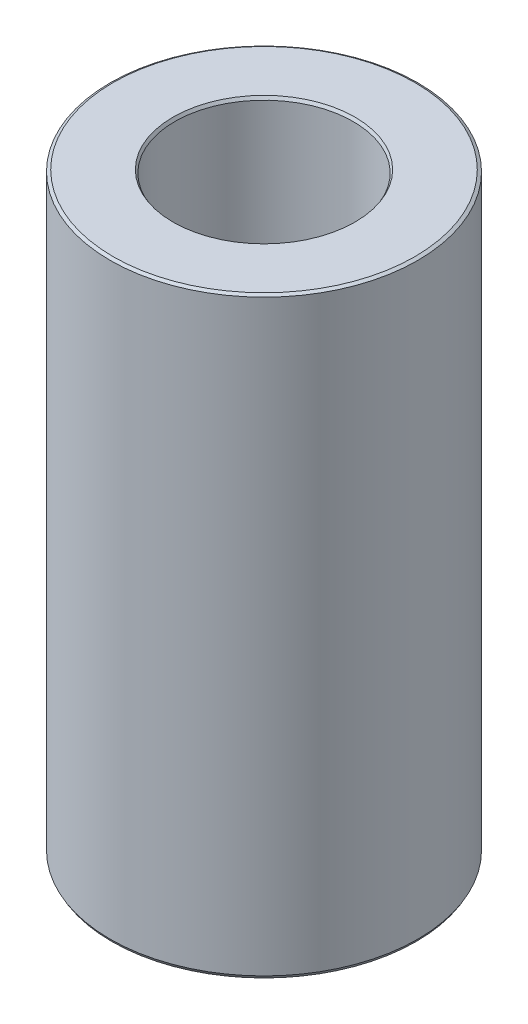
ISO-10303-21;
HEADER;
FILE_DESCRIPTION(('STEP AP214'),'2;1');
FILE_NAME('part.step','',(''),(''),'','','');
FILE_SCHEMA(('AUTOMOTIVE_DESIGN { 1 0 10303 214 1 1 1 1 }'));
ENDSEC;
DATA;
#1=APPLICATION_CONTEXT('core data for automotive mechanical design processes');
#2=APPLICATION_PROTOCOL_DEFINITION('international standard','automotive_design',2000,#1);
#3=PRODUCT_CONTEXT('',#1,'mechanical');
#4=PRODUCT('Part','Part','',(#3));
#5=PRODUCT_RELATED_PRODUCT_CATEGORY('part','',(#4));
#6=PRODUCT_DEFINITION_FORMATION('','',#4);
#7=PRODUCT_DEFINITION_CONTEXT('part definition',#1,'design');
#8=PRODUCT_DEFINITION('design','',#6,#7);
#9=PRODUCT_DEFINITION_SHAPE('','',#8);
#10=(LENGTH_UNIT() NAMED_UNIT(*) SI_UNIT(.MILLI.,.METRE.));
#11=(NAMED_UNIT(*) PLANE_ANGLE_UNIT() SI_UNIT($,.RADIAN.));
#12=(NAMED_UNIT(*) SI_UNIT($,.STERADIAN.) SOLID_ANGLE_UNIT());
#13=UNCERTAINTY_MEASURE_WITH_UNIT(LENGTH_MEASURE(1.E-05),#10,'distance_accuracy_value','');
#14=(GEOMETRIC_REPRESENTATION_CONTEXT(3) GLOBAL_UNCERTAINTY_ASSIGNED_CONTEXT((#13)) GLOBAL_UNIT_ASSIGNED_CONTEXT((#10,
#11,#12)) REPRESENTATION_CONTEXT('',''));
#15=CARTESIAN_POINT('',(0.,0.,0.));
#16=DIRECTION('',(0.,0.,1.));
#17=DIRECTION('',(1.,0.,0.));
#18=AXIS2_PLACEMENT_3D('',#15,#16,#17);
#19=CARTESIAN_POINT('',(0.,221.507115147404,0.));
#20=DIRECTION('',(0.,-1.,0.));
#21=DIRECTION('',(0.,0.,-1.));
#22=AXIS2_PLACEMENT_3D('',#19,#20,#21);
#23=CYLINDRICAL_SURFACE('',#22,57.5);
#24=CARTESIAN_POINT('',(0.,1.11630330257123,0.));
#25=DIRECTION('',(0.,1.,0.));
#26=DIRECTION('',(0.,0.,1.));
#27=AXIS2_PLACEMENT_3D('',#24,#25,#26);
#28=CIRCLE('',#27,57.5);
#29=CARTESIAN_POINT('',(0.,1.11630330257123,57.5));
#30=VERTEX_POINT('',#29);
#31=EDGE_CURVE('E10',#30,#30,#28,.T.);
#32=ORIENTED_EDGE('',*,*,#31,.T.);
#33=EDGE_LOOP('',(#32));
#34=FACE_BOUND('',#33,.T.);
#35=CARTESIAN_POINT('',(0.,220.862617135167,0.));
#36=DIRECTION('',(0.,1.,0.));
#37=DIRECTION('',(0.,0.,1.));
#38=AXIS2_PLACEMENT_3D('',#35,#36,#37);
#39=CIRCLE('',#38,57.5);
#40=CARTESIAN_POINT('',(0.,220.862617135167,57.5));
#41=VERTEX_POINT('',#40);
#42=EDGE_CURVE('E50',#41,#41,#39,.F.);
#43=ORIENTED_EDGE('',*,*,#42,.T.);
#44=EDGE_LOOP('',(#43));
#45=FACE_BOUND('',#44,.T.);
#46=ADVANCED_FACE('F39',(#34,#45),#23,.T.);
#47=CARTESIAN_POINT('',(0.,221.507115147404,0.));
#48=DIRECTION('',(0.,1.,0.));
#49=DIRECTION('',(0.,0.,1.));
#50=AXIS2_PLACEMENT_3D('',#47,#48,#49);
#51=PLANE('',#50);
#52=CARTESIAN_POINT('',(0.,221.507115147404,0.));
#53=DIRECTION('',(0.,1.,0.));
#54=DIRECTION('',(0.,0.,1.));
#55=AXIS2_PLACEMENT_3D('',#52,#53,#54);
#56=CIRCLE('',#55,34.0088767189524);
#57=CARTESIAN_POINT('',(0.,221.507115147404,34.0088767189524));
#58=VERTEX_POINT('',#57);
#59=EDGE_CURVE('E58',#58,#58,#56,.F.);
#60=ORIENTED_EDGE('',*,*,#59,.T.);
#61=EDGE_LOOP('',(#60));
#62=FACE_BOUND('',#61,.T.);
#63=CARTESIAN_POINT('',(0.,221.507115147404,0.));
#64=DIRECTION('',(0.,1.,0.));
#65=DIRECTION('',(0.,0.,1.));
#66=AXIS2_PLACEMENT_3D('',#63,#64,#65);
#67=CIRCLE('',#66,56.3836966974289);
#68=CARTESIAN_POINT('',(0.,221.507115147404,56.3836966974289));
#69=VERTEX_POINT('',#68);
#70=EDGE_CURVE('E61',#69,#69,#67,.T.);
#71=ORIENTED_EDGE('',*,*,#70,.T.);
#72=EDGE_LOOP('',(#71));
#73=FACE_BOUND('',#72,.T.);
#74=ADVANCED_FACE('F88',(#62,#73),#51,.T.);
#75=CARTESIAN_POINT('',(0.,0.,0.));
#76=DIRECTION('',(0.,1.,0.));
#77=DIRECTION('',(0.,0.,1.));
#78=AXIS2_PLACEMENT_3D('',#75,#76,#77);
#79=PLANE('',#78);
#80=CARTESIAN_POINT('',(0.,0.,0.));
#81=DIRECTION('',(0.,1.,0.));
#82=DIRECTION('',(0.,0.,1.));
#83=AXIS2_PLACEMENT_3D('',#80,#81,#82);
#84=CIRCLE('',#83,34.4806820092869);
#85=CARTESIAN_POINT('',(0.,0.,34.4806820092869));
#86=VERTEX_POINT('',#85);
#87=EDGE_CURVE('E51',#86,#86,#84,.T.);
#88=ORIENTED_EDGE('',*,*,#87,.T.);
#89=EDGE_LOOP('',(#88));
#90=FACE_BOUND('',#89,.T.);
#91=CARTESIAN_POINT('',(0.,0.,0.));
#92=DIRECTION('',(0.,1.,0.));
#93=DIRECTION('',(0.,0.,1.));
#94=AXIS2_PLACEMENT_3D('',#91,#92,#93);
#95=CIRCLE('',#94,56.8555019877632);
#96=CARTESIAN_POINT('',(0.,0.,56.8555019877632));
#97=VERTEX_POINT('',#96);
#98=EDGE_CURVE('E54',#97,#97,#95,.F.);
#99=ORIENTED_EDGE('',*,*,#98,.T.);
#100=EDGE_LOOP('',(#99));
#101=FACE_BOUND('',#100,.T.);
#102=ADVANCED_FACE('F83',(#90,#101),#79,.F.);
#103=CARTESIAN_POINT('',(0.,221.507115147404,0.));
#104=DIRECTION('',(0.,-1.,0.));
#105=DIRECTION('',(0.,0.,-1.));
#106=AXIS2_PLACEMENT_3D('',#103,#104,#105);
#107=CYLINDRICAL_SURFACE('',#106,33.3643787067156);
#108=CARTESIAN_POINT('',(0.,220.390811844832,0.));
#109=DIRECTION('',(0.,1.,0.));
#110=DIRECTION('',(0.,0.,1.));
#111=AXIS2_PLACEMENT_3D('',#108,#109,#110);
#112=CIRCLE('',#111,33.3643787067156);
#113=CARTESIAN_POINT('',(0.,220.390811844832,33.3643787067156));
#114=VERTEX_POINT('',#113);
#115=EDGE_CURVE('E67',#114,#114,#112,.T.);
#116=ORIENTED_EDGE('',*,*,#115,.T.);
#117=EDGE_LOOP('',(#116));
#118=FACE_BOUND('',#117,.T.);
#119=CARTESIAN_POINT('',(0.,0.644498012236761,0.));
#120=DIRECTION('',(0.,1.,0.));
#121=DIRECTION('',(0.,0.,1.));
#122=AXIS2_PLACEMENT_3D('',#119,#120,#121);
#123=CIRCLE('',#122,33.3643787067156);
#124=CARTESIAN_POINT('',(0.,0.644498012236761,33.3643787067156));
#125=VERTEX_POINT('',#124);
#126=EDGE_CURVE('E69',#125,#125,#123,.F.);
#127=ORIENTED_EDGE('',*,*,#126,.T.);
#128=EDGE_LOOP('',(#127));
#129=FACE_BOUND('',#128,.T.);
#130=ADVANCED_FACE('F71',(#118,#129),#107,.F.);
#131=CARTESIAN_POINT('',(0.,220.390811844832,0.));
#132=DIRECTION('',(0.,1.,0.));
#133=DIRECTION('',(0.,0.,1.));
#134=AXIS2_PLACEMENT_3D('',#131,#132,#133);
#135=CONICAL_SURFACE('',#134,33.3643787067156,0.52359877559828);
#136=ORIENTED_EDGE('',*,*,#59,.F.);
#137=EDGE_LOOP('',(#136));
#138=FACE_BOUND('',#137,.T.);
#139=ORIENTED_EDGE('',*,*,#115,.F.);
#140=EDGE_LOOP('',(#139));
#141=FACE_BOUND('',#140,.T.);
#142=ADVANCED_FACE('F77',(#138,#141),#135,.F.);
#143=CARTESIAN_POINT('',(0.,0.,0.));
#144=DIRECTION('',(0.,-1.,0.));
#145=DIRECTION('',(0.,0.,-1.));
#146=AXIS2_PLACEMENT_3D('',#143,#144,#145);
#147=CONICAL_SURFACE('',#146,34.4806820092869,1.0471975511966);
#148=ORIENTED_EDGE('',*,*,#126,.F.);
#149=EDGE_LOOP('',(#148));
#150=FACE_BOUND('',#149,.T.);
#151=ORIENTED_EDGE('',*,*,#87,.F.);
#152=EDGE_LOOP('',(#151));
#153=FACE_BOUND('',#152,.T.);
#154=ADVANCED_FACE('F73',(#150,#153),#147,.F.);
#155=CARTESIAN_POINT('',(0.,1.11630330257123,0.));
#156=DIRECTION('',(0.,1.,0.));
#157=DIRECTION('',(0.,0.,1.));
#158=AXIS2_PLACEMENT_3D('',#155,#156,#157);
#159=CONICAL_SURFACE('',#158,57.5,0.523598775598298);
#160=ORIENTED_EDGE('',*,*,#98,.F.);
#161=EDGE_LOOP('',(#160));
#162=FACE_BOUND('',#161,.T.);
#163=ORIENTED_EDGE('',*,*,#31,.F.);
#164=EDGE_LOOP('',(#163));
#165=FACE_BOUND('',#164,.T.);
#166=ADVANCED_FACE('F76',(#162,#165),#159,.T.);
#167=CARTESIAN_POINT('',(0.,221.507115147404,0.));
#168=DIRECTION('',(0.,-1.,0.));
#169=DIRECTION('',(0.,0.,-1.));
#170=AXIS2_PLACEMENT_3D('',#167,#168,#169);
#171=CONICAL_SURFACE('',#170,56.3836966974289,1.04719755119658);
#172=ORIENTED_EDGE('',*,*,#42,.F.);
#173=EDGE_LOOP('',(#172));
#174=FACE_BOUND('',#173,.T.);
#175=ORIENTED_EDGE('',*,*,#70,.F.);
#176=EDGE_LOOP('',(#175));
#177=FACE_BOUND('',#176,.T.);
#178=ADVANCED_FACE('F45',(#174,#177),#171,.T.);
#179=CLOSED_SHELL('',(#46,#74,#102,#130,#142,#154,#166,#178));
#180=MANIFOLD_SOLID_BREP('B2',#179);
#181=ADVANCED_BREP_SHAPE_REPRESENTATION('',(#18,#180),#14);
#182=SHAPE_DEFINITION_REPRESENTATION(#9,#181);
ENDSEC;
END-ISO-10303-21;
